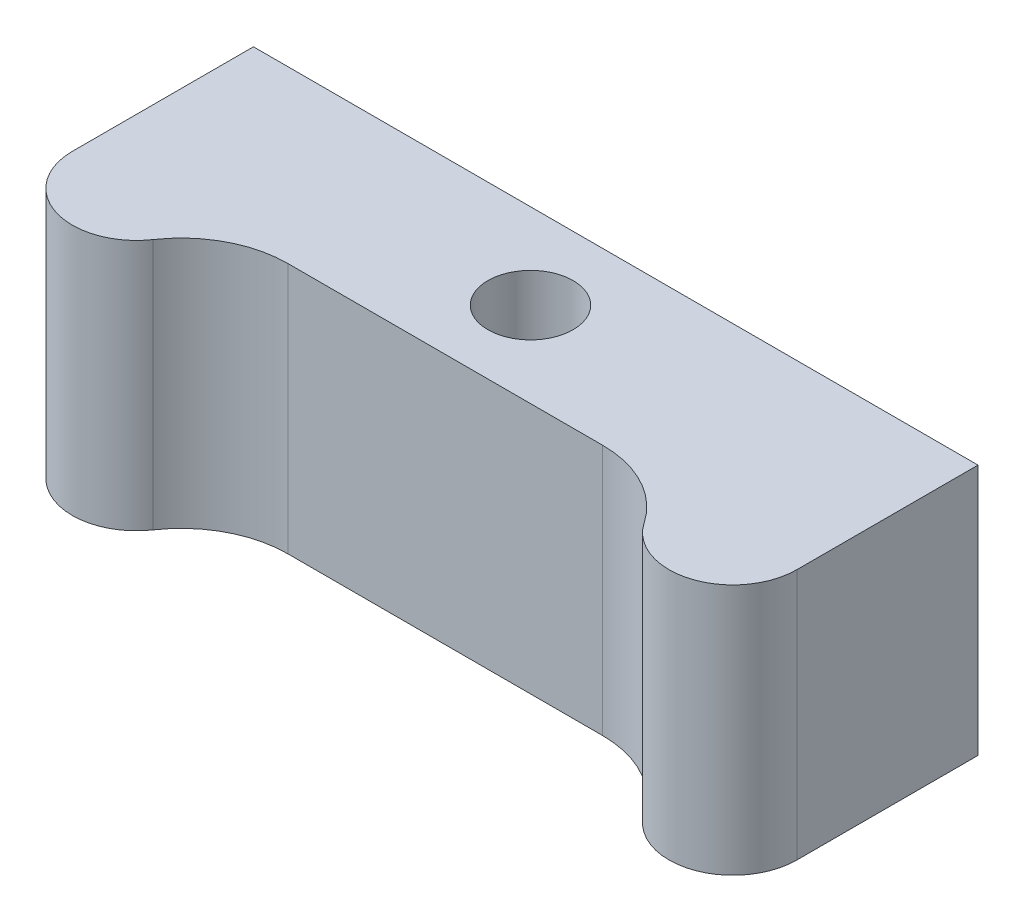
ISO-10303-21;
HEADER;
FILE_DESCRIPTION(('STEP AP214'),'2;1');
FILE_NAME('part.step','',(''),(''),'','','');
FILE_SCHEMA(('AUTOMOTIVE_DESIGN { 1 0 10303 214 1 1 1 1 }'));
ENDSEC;
DATA;
#1=APPLICATION_CONTEXT('core data for automotive mechanical design processes');
#2=APPLICATION_PROTOCOL_DEFINITION('international standard','automotive_design',2000,#1);
#3=PRODUCT_CONTEXT('',#1,'mechanical');
#4=PRODUCT('Part','Part','',(#3));
#5=PRODUCT_RELATED_PRODUCT_CATEGORY('part','',(#4));
#6=PRODUCT_DEFINITION_FORMATION('','',#4);
#7=PRODUCT_DEFINITION_CONTEXT('part definition',#1,'design');
#8=PRODUCT_DEFINITION('design','',#6,#7);
#9=PRODUCT_DEFINITION_SHAPE('','',#8);
#10=(LENGTH_UNIT() NAMED_UNIT(*) SI_UNIT(.MILLI.,.METRE.));
#11=(NAMED_UNIT(*) PLANE_ANGLE_UNIT() SI_UNIT($,.RADIAN.));
#12=(NAMED_UNIT(*) SI_UNIT($,.STERADIAN.) SOLID_ANGLE_UNIT());
#13=UNCERTAINTY_MEASURE_WITH_UNIT(LENGTH_MEASURE(1.E-05),#10,'distance_accuracy_value','');
#14=(GEOMETRIC_REPRESENTATION_CONTEXT(3) GLOBAL_UNCERTAINTY_ASSIGNED_CONTEXT((#13)) GLOBAL_UNIT_ASSIGNED_CONTEXT((#10,
#11,#12)) REPRESENTATION_CONTEXT('',''));
#15=CARTESIAN_POINT('',(0.,0.,0.));
#16=DIRECTION('',(0.,0.,1.));
#17=DIRECTION('',(1.,0.,0.));
#18=AXIS2_PLACEMENT_3D('',#15,#16,#17);
#19=CARTESIAN_POINT('',(7.38562172233853,11.8,9.));
#20=DIRECTION('',(0.,-1.,0.));
#21=DIRECTION('',(0.,0.,-1.));
#22=AXIS2_PLACEMENT_3D('',#19,#20,#21);
#23=CYLINDRICAL_SURFACE('',#22,5.);
#24=CARTESIAN_POINT('',(7.38562172233853,0.,9.));
#25=DIRECTION('',(0.,1.,0.));
#26=DIRECTION('',(0.,0.,1.));
#27=AXIS2_PLACEMENT_3D('',#24,#25,#26);
#28=CIRCLE('',#27,5.);
#29=CARTESIAN_POINT('',(11.519608145877,0.,6.1875));
#30=VERTEX_POINT('',#29);
#31=CARTESIAN_POINT('',(7.38562172233853,0.,4.));
#32=VERTEX_POINT('',#31);
#33=EDGE_CURVE('E136',#30,#32,#28,.T.);
#34=ORIENTED_EDGE('',*,*,#33,.F.);
#35=DIRECTION('',(0.,-1.,0.));
#36=VECTOR('',#35,1.);
#37=CARTESIAN_POINT('',(11.519608145877,11.8,6.1875));
#38=LINE('',#37,#36);
#39=CARTESIAN_POINT('',(11.519608145877,11.8,6.1875));
#40=VERTEX_POINT('',#39);
#41=EDGE_CURVE('E11',#40,#30,#38,.T.);
#42=ORIENTED_EDGE('',*,*,#41,.F.);
#43=CARTESIAN_POINT('',(7.38562172233853,11.8,9.));
#44=DIRECTION('',(0.,1.,0.));
#45=DIRECTION('',(0.,0.,1.));
#46=AXIS2_PLACEMENT_3D('',#43,#44,#45);
#47=CIRCLE('',#46,5.);
#48=CARTESIAN_POINT('',(7.38562172233853,11.8,4.));
#49=VERTEX_POINT('',#48);
#50=EDGE_CURVE('E155',#40,#49,#47,.T.);
#51=ORIENTED_EDGE('',*,*,#50,.T.);
#52=DIRECTION('',(0.,-1.,0.));
#53=VECTOR('',#52,1.);
#54=CARTESIAN_POINT('',(7.38562172233853,11.8,4.));
#55=LINE('',#54,#53);
#56=EDGE_CURVE('E59',#49,#32,#55,.T.);
#57=ORIENTED_EDGE('',*,*,#56,.T.);
#58=EDGE_LOOP('',(#34,#42,#51,#57));
#59=FACE_BOUND('',#58,.T.);
#60=ADVANCED_FACE('F43',(#59),#23,.F.);
#61=CARTESIAN_POINT('',(14.,11.8,4.5));
#62=DIRECTION('',(0.,-1.,0.));
#63=DIRECTION('',(0.,0.,-1.));
#64=AXIS2_PLACEMENT_3D('',#61,#62,#63);
#65=CYLINDRICAL_SURFACE('',#64,3.);
#66=CARTESIAN_POINT('',(14.,0.,4.5));
#67=DIRECTION('',(0.,1.,0.));
#68=DIRECTION('',(0.,0.,1.));
#69=AXIS2_PLACEMENT_3D('',#66,#67,#68);
#70=CIRCLE('',#69,3.);
#71=CARTESIAN_POINT('',(17.,0.,4.5));
#72=VERTEX_POINT('',#71);
#73=EDGE_CURVE('E138',#30,#72,#70,.T.);
#74=ORIENTED_EDGE('',*,*,#73,.T.);
#75=DIRECTION('',(0.,-1.,0.));
#76=VECTOR('',#75,1.);
#77=CARTESIAN_POINT('',(17.,11.8,4.5));
#78=LINE('',#77,#76);
#79=CARTESIAN_POINT('',(17.,11.8,4.5));
#80=VERTEX_POINT('',#79);
#81=EDGE_CURVE('E51',#80,#72,#78,.T.);
#82=ORIENTED_EDGE('',*,*,#81,.F.);
#83=CARTESIAN_POINT('',(14.,11.8,4.5));
#84=DIRECTION('',(0.,1.,0.));
#85=DIRECTION('',(0.,0.,1.));
#86=AXIS2_PLACEMENT_3D('',#83,#84,#85);
#87=CIRCLE('',#86,3.);
#88=EDGE_CURVE('E183',#40,#80,#87,.T.);
#89=ORIENTED_EDGE('',*,*,#88,.F.);
#90=ORIENTED_EDGE('',*,*,#41,.T.);
#91=EDGE_LOOP('',(#74,#82,#89,#90));
#92=FACE_BOUND('',#91,.T.);
#93=ADVANCED_FACE('F211',(#92),#65,.T.);
#94=CARTESIAN_POINT('',(17.,11.8,0.));
#95=DIRECTION('',(-1.,0.,0.));
#96=DIRECTION('',(0.,0.,1.));
#97=AXIS2_PLACEMENT_3D('',#94,#95,#96);
#98=PLANE('',#97);
#99=DIRECTION('',(0.,0.,-1.));
#100=VECTOR('',#99,1.);
#101=CARTESIAN_POINT('',(17.,0.,0.));
#102=LINE('',#101,#100);
#103=CARTESIAN_POINT('',(17.,0.,-4.));
#104=VERTEX_POINT('',#103);
#105=EDGE_CURVE('E141',#72,#104,#102,.T.);
#106=ORIENTED_EDGE('',*,*,#105,.T.);
#107=DIRECTION('',(0.,-1.,0.));
#108=VECTOR('',#107,1.);
#109=CARTESIAN_POINT('',(17.,11.8,-4.));
#110=LINE('',#109,#108);
#111=CARTESIAN_POINT('',(17.,11.8,-4.));
#112=VERTEX_POINT('',#111);
#113=EDGE_CURVE('E161',#112,#104,#110,.T.);
#114=ORIENTED_EDGE('',*,*,#113,.F.);
#115=DIRECTION('',(0.,0.,-1.));
#116=VECTOR('',#115,1.);
#117=CARTESIAN_POINT('',(17.,11.8,0.));
#118=LINE('',#117,#116);
#119=EDGE_CURVE('E170',#80,#112,#118,.T.);
#120=ORIENTED_EDGE('',*,*,#119,.F.);
#121=ORIENTED_EDGE('',*,*,#81,.T.);
#122=EDGE_LOOP('',(#106,#114,#120,#121));
#123=FACE_BOUND('',#122,.T.);
#124=ADVANCED_FACE('F168',(#123),#98,.F.);
#125=CARTESIAN_POINT('',(0.,11.8,-4.));
#126=DIRECTION('',(0.,0.,1.));
#127=DIRECTION('',(1.,0.,0.));
#128=AXIS2_PLACEMENT_3D('',#125,#126,#127);
#129=PLANE('',#128);
#130=DIRECTION('',(-1.,0.,0.));
#131=VECTOR('',#130,1.);
#132=CARTESIAN_POINT('',(0.,0.,-4.));
#133=LINE('',#132,#131);
#134=CARTESIAN_POINT('',(-17.,0.,-4.));
#135=VERTEX_POINT('',#134);
#136=EDGE_CURVE('E143',#104,#135,#133,.T.);
#137=ORIENTED_EDGE('',*,*,#136,.T.);
#138=DIRECTION('',(0.,-1.,0.));
#139=VECTOR('',#138,1.);
#140=CARTESIAN_POINT('',(-17.,11.8,-4.));
#141=LINE('',#140,#139);
#142=CARTESIAN_POINT('',(-17.,11.8,-4.));
#143=VERTEX_POINT('',#142);
#144=EDGE_CURVE('E159',#143,#135,#141,.T.);
#145=ORIENTED_EDGE('',*,*,#144,.F.);
#146=DIRECTION('',(-1.,0.,0.));
#147=VECTOR('',#146,1.);
#148=CARTESIAN_POINT('',(0.,11.8,-4.));
#149=LINE('',#148,#147);
#150=EDGE_CURVE('E181',#112,#143,#149,.T.);
#151=ORIENTED_EDGE('',*,*,#150,.F.);
#152=ORIENTED_EDGE('',*,*,#113,.T.);
#153=EDGE_LOOP('',(#137,#145,#151,#152));
#154=FACE_BOUND('',#153,.T.);
#155=ADVANCED_FACE('F179',(#154),#129,.F.);
#156=CARTESIAN_POINT('',(-17.,11.8,0.));
#157=DIRECTION('',(-1.,0.,0.));
#158=DIRECTION('',(0.,0.,1.));
#159=AXIS2_PLACEMENT_3D('',#156,#157,#158);
#160=PLANE('',#159);
#161=DIRECTION('',(0.,0.,-1.));
#162=VECTOR('',#161,1.);
#163=CARTESIAN_POINT('',(-17.,0.,0.));
#164=LINE('',#163,#162);
#165=CARTESIAN_POINT('',(-17.,0.,4.5));
#166=VERTEX_POINT('',#165);
#167=EDGE_CURVE('E146',#166,#135,#164,.T.);
#168=ORIENTED_EDGE('',*,*,#167,.F.);
#169=DIRECTION('',(0.,-1.,0.));
#170=VECTOR('',#169,1.);
#171=CARTESIAN_POINT('',(-17.,11.8,4.5));
#172=LINE('',#171,#170);
#173=CARTESIAN_POINT('',(-17.,11.8,4.5));
#174=VERTEX_POINT('',#173);
#175=EDGE_CURVE('E128',#174,#166,#172,.T.);
#176=ORIENTED_EDGE('',*,*,#175,.F.);
#177=DIRECTION('',(0.,0.,-1.));
#178=VECTOR('',#177,1.);
#179=CARTESIAN_POINT('',(-17.,11.8,0.));
#180=LINE('',#179,#178);
#181=EDGE_CURVE('E118',#174,#143,#180,.T.);
#182=ORIENTED_EDGE('',*,*,#181,.T.);
#183=ORIENTED_EDGE('',*,*,#144,.T.);
#184=EDGE_LOOP('',(#168,#176,#182,#183));
#185=FACE_BOUND('',#184,.T.);
#186=ADVANCED_FACE('F216',(#185),#160,.T.);
#187=CARTESIAN_POINT('',(-14.,11.8,4.5));
#188=DIRECTION('',(0.,-1.,0.));
#189=DIRECTION('',(0.,0.,-1.));
#190=AXIS2_PLACEMENT_3D('',#187,#188,#189);
#191=CYLINDRICAL_SURFACE('',#190,3.);
#192=CARTESIAN_POINT('',(-14.,0.,4.5));
#193=DIRECTION('',(0.,1.,0.));
#194=DIRECTION('',(0.,0.,1.));
#195=AXIS2_PLACEMENT_3D('',#192,#193,#194);
#196=CIRCLE('',#195,3.);
#197=CARTESIAN_POINT('',(-11.5196081458769,0.,6.1875));
#198=VERTEX_POINT('',#197);
#199=EDGE_CURVE('E125',#166,#198,#196,.T.);
#200=ORIENTED_EDGE('',*,*,#199,.T.);
#201=DIRECTION('',(0.,-1.,0.));
#202=VECTOR('',#201,1.);
#203=CARTESIAN_POINT('',(-11.5196081458769,11.8,6.1875));
#204=LINE('',#203,#202);
#205=CARTESIAN_POINT('',(-11.5196081458769,11.8,6.1875));
#206=VERTEX_POINT('',#205);
#207=EDGE_CURVE('E122',#206,#198,#204,.T.);
#208=ORIENTED_EDGE('',*,*,#207,.F.);
#209=CARTESIAN_POINT('',(-14.,11.8,4.5));
#210=DIRECTION('',(0.,1.,0.));
#211=DIRECTION('',(0.,0.,1.));
#212=AXIS2_PLACEMENT_3D('',#209,#210,#211);
#213=CIRCLE('',#212,3.);
#214=EDGE_CURVE('E110',#174,#206,#213,.T.);
#215=ORIENTED_EDGE('',*,*,#214,.F.);
#216=ORIENTED_EDGE('',*,*,#175,.T.);
#217=EDGE_LOOP('',(#200,#208,#215,#216));
#218=FACE_BOUND('',#217,.T.);
#219=ADVANCED_FACE('F123',(#218),#191,.T.);
#220=CARTESIAN_POINT('',(-7.38562172233852,11.8,9.));
#221=DIRECTION('',(0.,-1.,0.));
#222=DIRECTION('',(0.,0.,-1.));
#223=AXIS2_PLACEMENT_3D('',#220,#221,#222);
#224=CYLINDRICAL_SURFACE('',#223,5.);
#225=CARTESIAN_POINT('',(-7.38562172233852,0.,9.));
#226=DIRECTION('',(0.,1.,0.));
#227=DIRECTION('',(0.,0.,1.));
#228=AXIS2_PLACEMENT_3D('',#225,#226,#227);
#229=CIRCLE('',#228,5.);
#230=CARTESIAN_POINT('',(-7.38562172233852,0.,4.));
#231=VERTEX_POINT('',#230);
#232=EDGE_CURVE('E150',#231,#198,#229,.T.);
#233=ORIENTED_EDGE('',*,*,#232,.F.);
#234=DIRECTION('',(0.,-1.,0.));
#235=VECTOR('',#234,1.);
#236=CARTESIAN_POINT('',(-7.38562172233852,11.8,4.));
#237=LINE('',#236,#235);
#238=CARTESIAN_POINT('',(-7.38562172233852,11.8,4.));
#239=VERTEX_POINT('',#238);
#240=EDGE_CURVE('E84',#239,#231,#237,.T.);
#241=ORIENTED_EDGE('',*,*,#240,.F.);
#242=CARTESIAN_POINT('',(-7.38562172233852,11.8,9.));
#243=DIRECTION('',(0.,1.,0.));
#244=DIRECTION('',(0.,0.,1.));
#245=AXIS2_PLACEMENT_3D('',#242,#243,#244);
#246=CIRCLE('',#245,5.);
#247=EDGE_CURVE('E116',#239,#206,#246,.T.);
#248=ORIENTED_EDGE('',*,*,#247,.T.);
#249=ORIENTED_EDGE('',*,*,#207,.T.);
#250=EDGE_LOOP('',(#233,#241,#248,#249));
#251=FACE_BOUND('',#250,.T.);
#252=ADVANCED_FACE('F130',(#251),#224,.F.);
#253=CARTESIAN_POINT('',(0.,11.8,4.));
#254=DIRECTION('',(0.,0.,1.));
#255=DIRECTION('',(1.,0.,0.));
#256=AXIS2_PLACEMENT_3D('',#253,#254,#255);
#257=PLANE('',#256);
#258=DIRECTION('',(-1.,0.,0.));
#259=VECTOR('',#258,1.);
#260=CARTESIAN_POINT('',(0.,0.,4.));
#261=LINE('',#260,#259);
#262=EDGE_CURVE('E152',#32,#231,#261,.T.);
#263=ORIENTED_EDGE('',*,*,#262,.F.);
#264=ORIENTED_EDGE('',*,*,#56,.F.);
#265=DIRECTION('',(-1.,0.,0.));
#266=VECTOR('',#265,1.);
#267=CARTESIAN_POINT('',(0.,11.8,4.));
#268=LINE('',#267,#266);
#269=EDGE_CURVE('E131',#49,#239,#268,.T.);
#270=ORIENTED_EDGE('',*,*,#269,.T.);
#271=ORIENTED_EDGE('',*,*,#240,.T.);
#272=EDGE_LOOP('',(#263,#264,#270,#271));
#273=FACE_BOUND('',#272,.T.);
#274=ADVANCED_FACE('F202',(#273),#257,.T.);
#275=CARTESIAN_POINT('',(0.,11.8,0.));
#276=DIRECTION('',(0.,1.,0.));
#277=DIRECTION('',(0.,0.,1.));
#278=AXIS2_PLACEMENT_3D('',#275,#276,#277);
#279=PLANE('',#278);
#280=CARTESIAN_POINT('',(0.,11.8,0.));
#281=DIRECTION('',(0.,1.,0.));
#282=DIRECTION('',(0.,0.,1.));
#283=AXIS2_PLACEMENT_3D('',#280,#281,#282);
#284=CIRCLE('',#283,2.);
#285=CARTESIAN_POINT('',(0.,11.8,2.));
#286=VERTEX_POINT('',#285);
#287=EDGE_CURVE('E188',#286,#286,#284,.T.);
#288=ORIENTED_EDGE('',*,*,#287,.F.);
#289=EDGE_LOOP('',(#288));
#290=FACE_BOUND('',#289,.T.);
#291=ORIENTED_EDGE('',*,*,#50,.F.);
#292=ORIENTED_EDGE('',*,*,#88,.T.);
#293=ORIENTED_EDGE('',*,*,#119,.T.);
#294=ORIENTED_EDGE('',*,*,#150,.T.);
#295=ORIENTED_EDGE('',*,*,#181,.F.);
#296=ORIENTED_EDGE('',*,*,#214,.T.);
#297=ORIENTED_EDGE('',*,*,#247,.F.);
#298=ORIENTED_EDGE('',*,*,#269,.F.);
#299=EDGE_LOOP('',(#291,#292,#293,#294,#295,#296,#297,#298));
#300=FACE_BOUND('',#299,.T.);
#301=ADVANCED_FACE('F113',(#290,#300),#279,.T.);
#302=CARTESIAN_POINT('',(0.,0.,0.));
#303=DIRECTION('',(0.,1.,0.));
#304=DIRECTION('',(0.,0.,1.));
#305=AXIS2_PLACEMENT_3D('',#302,#303,#304);
#306=PLANE('',#305);
#307=CARTESIAN_POINT('',(0.,0.,0.));
#308=DIRECTION('',(0.,1.,0.));
#309=DIRECTION('',(0.,0.,1.));
#310=AXIS2_PLACEMENT_3D('',#307,#308,#309);
#311=CIRCLE('',#310,2.);
#312=CARTESIAN_POINT('',(0.,0.,2.));
#313=VERTEX_POINT('',#312);
#314=EDGE_CURVE('E139',#313,#313,#311,.T.);
#315=ORIENTED_EDGE('',*,*,#314,.T.);
#316=EDGE_LOOP('',(#315));
#317=FACE_BOUND('',#316,.T.);
#318=ORIENTED_EDGE('',*,*,#33,.T.);
#319=ORIENTED_EDGE('',*,*,#262,.T.);
#320=ORIENTED_EDGE('',*,*,#232,.T.);
#321=ORIENTED_EDGE('',*,*,#199,.F.);
#322=ORIENTED_EDGE('',*,*,#167,.T.);
#323=ORIENTED_EDGE('',*,*,#136,.F.);
#324=ORIENTED_EDGE('',*,*,#105,.F.);
#325=ORIENTED_EDGE('',*,*,#73,.F.);
#326=EDGE_LOOP('',(#318,#319,#320,#321,#322,#323,#324,#325));
#327=FACE_BOUND('',#326,.T.);
#328=ADVANCED_FACE('F175',(#317,#327),#306,.F.);
#329=CARTESIAN_POINT('',(0.,0.,0.));
#330=DIRECTION('',(0.,1.,0.));
#331=DIRECTION('',(0.,0.,1.));
#332=AXIS2_PLACEMENT_3D('',#329,#330,#331);
#333=CYLINDRICAL_SURFACE('',#332,2.);
#334=ORIENTED_EDGE('',*,*,#314,.F.);
#335=EDGE_LOOP('',(#334));
#336=FACE_BOUND('',#335,.T.);
#337=ORIENTED_EDGE('',*,*,#287,.T.);
#338=EDGE_LOOP('',(#337));
#339=FACE_BOUND('',#338,.T.);
#340=ADVANCED_FACE('F195',(#336,#339),#333,.F.);
#341=CLOSED_SHELL('',(#60,#93,#124,#155,#186,#219,#252,#274,#301,#328,#340));
#342=MANIFOLD_SOLID_BREP('B2',#341);
#343=ADVANCED_BREP_SHAPE_REPRESENTATION('',(#18,#342),#14);
#344=SHAPE_DEFINITION_REPRESENTATION(#9,#343);
ENDSEC;
END-ISO-10303-21;
